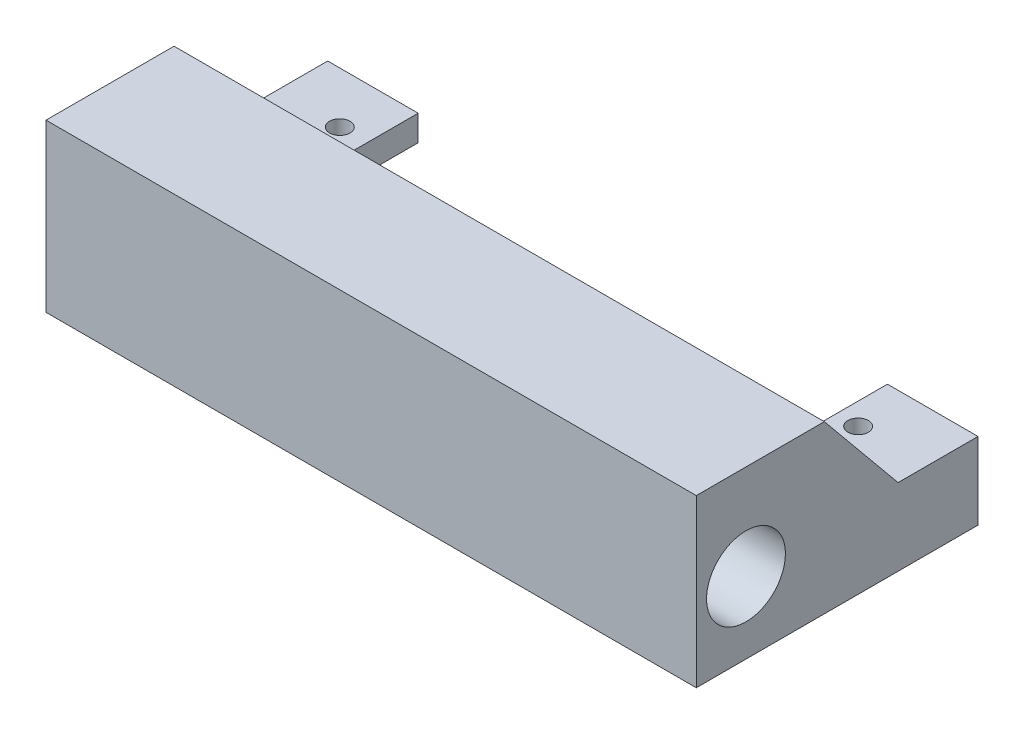
ISO-10303-21;
HEADER;
FILE_DESCRIPTION(('STEP AP214'),'2;1');
FILE_NAME('part.step','',(''),(''),'','','');
FILE_SCHEMA(('AUTOMOTIVE_DESIGN { 1 0 10303 214 1 1 1 1 }'));
ENDSEC;
DATA;
#1=APPLICATION_CONTEXT('core data for automotive mechanical design processes');
#2=APPLICATION_PROTOCOL_DEFINITION('international standard','automotive_design',2000,#1);
#3=PRODUCT_CONTEXT('',#1,'mechanical');
#4=PRODUCT('Part','Part','',(#3));
#5=PRODUCT_RELATED_PRODUCT_CATEGORY('part','',(#4));
#6=PRODUCT_DEFINITION_FORMATION('','',#4);
#7=PRODUCT_DEFINITION_CONTEXT('part definition',#1,'design');
#8=PRODUCT_DEFINITION('design','',#6,#7);
#9=PRODUCT_DEFINITION_SHAPE('','',#8);
#10=(LENGTH_UNIT() NAMED_UNIT(*) SI_UNIT(.MILLI.,.METRE.));
#11=(NAMED_UNIT(*) PLANE_ANGLE_UNIT() SI_UNIT($,.RADIAN.));
#12=(NAMED_UNIT(*) SI_UNIT($,.STERADIAN.) SOLID_ANGLE_UNIT());
#13=UNCERTAINTY_MEASURE_WITH_UNIT(LENGTH_MEASURE(1.E-05),#10,'distance_accuracy_value','');
#14=(GEOMETRIC_REPRESENTATION_CONTEXT(3) GLOBAL_UNCERTAINTY_ASSIGNED_CONTEXT((#13)) GLOBAL_UNIT_ASSIGNED_CONTEXT((#10,
#11,#12)) REPRESENTATION_CONTEXT('',''));
#15=CARTESIAN_POINT('',(0.,0.,0.));
#16=DIRECTION('',(0.,0.,1.));
#17=DIRECTION('',(1.,0.,0.));
#18=AXIS2_PLACEMENT_3D('',#15,#16,#17);
#19=CARTESIAN_POINT('',(0.,5.,0.));
#20=DIRECTION('',(0.,1.,0.));
#21=DIRECTION('',(0.,0.,1.));
#22=AXIS2_PLACEMENT_3D('',#19,#20,#21);
#23=PLANE('',#22);
#24=CARTESIAN_POINT('',(-50.22,5.,-15.2));
#25=DIRECTION('',(0.,1.,0.));
#26=DIRECTION('',(0.,0.,1.));
#27=AXIS2_PLACEMENT_3D('',#24,#25,#26);
#28=CIRCLE('',#27,2.);
#29=CARTESIAN_POINT('',(-50.22,5.,-13.2));
#30=VERTEX_POINT('',#29);
#31=EDGE_CURVE('E189',#30,#30,#28,.T.);
#32=ORIENTED_EDGE('',*,*,#31,.F.);
#33=EDGE_LOOP('',(#32));
#34=FACE_BOUND('',#33,.T.);
#35=DIRECTION('',(0.,0.,-1.));
#36=VECTOR('',#35,1.);
#37=CARTESIAN_POINT('',(-62.58,5.,0.));
#38=LINE('',#37,#36);
#39=CARTESIAN_POINT('',(-62.58,5.,-9.59999999999992));
#40=VERTEX_POINT('',#39);
#41=CARTESIAN_POINT('',(-62.58,5.,-25.2));
#42=VERTEX_POINT('',#41);
#43=EDGE_CURVE('E201',#40,#42,#38,.T.);
#44=ORIENTED_EDGE('',*,*,#43,.F.);
#45=DIRECTION('',(1.,0.,0.));
#46=VECTOR('',#45,1.);
#47=CARTESIAN_POINT('',(-156.62,4.99999999999998,-9.59999999999987));
#48=LINE('',#47,#46);
#49=CARTESIAN_POINT('',(-44.92,4.99999999999998,-9.59999999999993));
#50=VERTEX_POINT('',#49);
#51=EDGE_CURVE('E262',#40,#50,#48,.T.);
#52=ORIENTED_EDGE('',*,*,#51,.T.);
#53=DIRECTION('',(0.,0.,-1.));
#54=VECTOR('',#53,1.);
#55=CARTESIAN_POINT('',(-44.92,4.99999999999998,5.80000000000001));
#56=LINE('',#55,#54);
#57=CARTESIAN_POINT('',(-44.92,4.99999999999998,-25.2));
#58=VERTEX_POINT('',#57);
#59=EDGE_CURVE('E221',#50,#58,#56,.T.);
#60=ORIENTED_EDGE('',*,*,#59,.T.);
#61=DIRECTION('',(1.,0.,0.));
#62=VECTOR('',#61,1.);
#63=CARTESIAN_POINT('',(0.,5.,-25.2));
#64=LINE('',#63,#62);
#65=EDGE_CURVE('E309',#42,#58,#64,.T.);
#66=ORIENTED_EDGE('',*,*,#65,.F.);
#67=EDGE_LOOP('',(#44,#52,#60,#66));
#68=FACE_BOUND('',#67,.T.);
#69=ADVANCED_FACE('F48',(#34,#68),#23,.T.);
#70=CARTESIAN_POINT('',(0.,12.5,0.));
#71=DIRECTION('',(0.,1.,0.));
#72=DIRECTION('',(0.,0.,1.));
#73=AXIS2_PLACEMENT_3D('',#70,#71,#72);
#74=PLANE('',#73);
#75=DIRECTION('',(0.,0.,-1.));
#76=VECTOR('',#75,1.);
#77=CARTESIAN_POINT('',(-44.92,12.5,4.80000000000003));
#78=LINE('',#77,#76);
#79=CARTESIAN_POINT('',(-44.92,12.5,4.80000000000003));
#80=VERTEX_POINT('',#79);
#81=CARTESIAN_POINT('',(-44.92,12.5,0.));
#82=VERTEX_POINT('',#81);
#83=EDGE_CURVE('E214',#80,#82,#78,.T.);
#84=ORIENTED_EDGE('',*,*,#83,.F.);
#85=DIRECTION('',(-1.,0.,0.));
#86=VECTOR('',#85,1.);
#87=CARTESIAN_POINT('',(0.,12.5,4.80000000000001));
#88=LINE('',#87,#86);
#89=CARTESIAN_POINT('',(46.7,12.5,4.80000000000001));
#90=VERTEX_POINT('',#89);
#91=EDGE_CURVE('E303',#90,#80,#88,.T.);
#92=ORIENTED_EDGE('',*,*,#91,.F.);
#93=DIRECTION('',(0.,0.,-1.));
#94=VECTOR('',#93,1.);
#95=CARTESIAN_POINT('',(46.7,12.5,-3.42857142857141));
#96=LINE('',#95,#94);
#97=CARTESIAN_POINT('',(46.7,12.5,0.));
#98=VERTEX_POINT('',#97);
#99=EDGE_CURVE('E252',#90,#98,#96,.T.);
#100=ORIENTED_EDGE('',*,*,#99,.T.);
#101=DIRECTION('',(1.,0.,0.));
#102=VECTOR('',#101,1.);
#103=CARTESIAN_POINT('',(0.,12.5,0.));
#104=LINE('',#103,#102);
#105=EDGE_CURVE('E301',#82,#98,#104,.T.);
#106=ORIENTED_EDGE('',*,*,#105,.F.);
#107=EDGE_LOOP('',(#84,#92,#100,#106));
#108=FACE_BOUND('',#107,.T.);
#109=ADVANCED_FACE('F343',(#108),#74,.T.);
#110=CARTESIAN_POINT('',(0.,0.,4.80000000000001));
#111=DIRECTION('',(0.,0.,1.));
#112=DIRECTION('',(1.,0.,0.));
#113=AXIS2_PLACEMENT_3D('',#110,#111,#112);
#114=PLANE('',#113);
#115=ORIENTED_EDGE('',*,*,#91,.T.);
#116=DIRECTION('',(0.,-1.,0.));
#117=VECTOR('',#116,1.);
#118=CARTESIAN_POINT('',(-44.92,22.5,4.80000000000003));
#119=LINE('',#118,#117);
#120=CARTESIAN_POINT('',(-44.92,22.5,4.80000000000003));
#121=VERTEX_POINT('',#120);
#122=EDGE_CURVE('E211',#121,#80,#119,.T.);
#123=ORIENTED_EDGE('',*,*,#122,.F.);
#124=DIRECTION('',(1.,0.,0.));
#125=VECTOR('',#124,1.);
#126=CARTESIAN_POINT('',(0.,22.5,4.80000000000001));
#127=LINE('',#126,#125);
#128=CARTESIAN_POINT('',(46.7,22.5,4.80000000000003));
#129=VERTEX_POINT('',#128);
#130=EDGE_CURVE('E298',#121,#129,#127,.T.);
#131=ORIENTED_EDGE('',*,*,#130,.T.);
#132=DIRECTION('',(0.,-1.,0.));
#133=VECTOR('',#132,1.);
#134=CARTESIAN_POINT('',(46.7,12.5,4.80000000000001));
#135=LINE('',#134,#133);
#136=EDGE_CURVE('E249',#129,#90,#135,.T.);
#137=ORIENTED_EDGE('',*,*,#136,.T.);
#138=EDGE_LOOP('',(#115,#123,#131,#137));
#139=FACE_BOUND('',#138,.T.);
#140=ADVANCED_FACE('F350',(#139),#114,.F.);
#141=CARTESIAN_POINT('',(96.62,3.99999999999998,20.1000000000001));
#142=DIRECTION('',(-1.,0.,0.));
#143=DIRECTION('',(0.,0.,1.));
#144=AXIS2_PLACEMENT_3D('',#141,#142,#143);
#145=CYLINDRICAL_SURFACE('',#144,4.5);
#146=CARTESIAN_POINT('',(-38.08,3.99999999999998,20.1));
#147=DIRECTION('',(-1.,0.,0.));
#148=DIRECTION('',(0.,0.,1.));
#149=AXIS2_PLACEMENT_3D('',#146,#147,#148);
#150=CIRCLE('',#149,4.5);
#151=CARTESIAN_POINT('',(-38.08,3.99999999999998,24.6));
#152=VERTEX_POINT('',#151);
#153=EDGE_CURVE('E290',#152,#152,#150,.F.);
#154=ORIENTED_EDGE('',*,*,#153,.F.);
#155=EDGE_LOOP('',(#154));
#156=FACE_BOUND('',#155,.T.);
#157=CARTESIAN_POINT('',(39.88,3.99999999999998,20.1));
#158=DIRECTION('',(1.,0.,0.));
#159=DIRECTION('',(0.,0.,-1.));
#160=AXIS2_PLACEMENT_3D('',#157,#158,#159);
#161=CIRCLE('',#160,4.5);
#162=CARTESIAN_POINT('',(39.88,3.99999999999998,15.6));
#163=VERTEX_POINT('',#162);
#164=EDGE_CURVE('E228',#163,#163,#161,.T.);
#165=ORIENTED_EDGE('',*,*,#164,.T.);
#166=EDGE_LOOP('',(#165));
#167=FACE_BOUND('',#166,.T.);
#168=ADVANCED_FACE('F456',(#156,#167),#145,.F.);
#169=CARTESIAN_POINT('',(0.,5.,-25.2));
#170=DIRECTION('',(0.,0.,-1.));
#171=DIRECTION('',(-1.,0.,0.));
#172=AXIS2_PLACEMENT_3D('',#169,#170,#171);
#173=PLANE('',#172);
#174=DIRECTION('',(-1.,0.,0.));
#175=VECTOR('',#174,1.);
#176=CARTESIAN_POINT('',(63.38,-10.,-25.2));
#177=LINE('',#176,#175);
#178=CARTESIAN_POINT('',(64.3800000000001,-10.,-25.2));
#179=VERTEX_POINT('',#178);
#180=CARTESIAN_POINT('',(59.18,-10.,-25.2));
#181=VERTEX_POINT('',#180);
#182=EDGE_CURVE('E166',#179,#181,#177,.T.);
#183=ORIENTED_EDGE('',*,*,#182,.T.);
#184=DIRECTION('',(0.,1.,0.));
#185=VECTOR('',#184,1.);
#186=CARTESIAN_POINT('',(59.18,-10.,-25.2));
#187=LINE('',#186,#185);
#188=CARTESIAN_POINT('',(59.18,0.,-25.2));
#189=VERTEX_POINT('',#188);
#190=EDGE_CURVE('E169',#181,#189,#187,.T.);
#191=ORIENTED_EDGE('',*,*,#190,.T.);
#192=DIRECTION('',(1.,0.,0.));
#193=VECTOR('',#192,1.);
#194=CARTESIAN_POINT('',(0.,0.,-25.2));
#195=LINE('',#194,#193);
#196=CARTESIAN_POINT('',(46.7,0.,-25.2));
#197=VERTEX_POINT('',#196);
#198=EDGE_CURVE('E63',#197,#189,#195,.T.);
#199=ORIENTED_EDGE('',*,*,#198,.F.);
#200=DIRECTION('',(0.,-1.,0.));
#201=VECTOR('',#200,1.);
#202=CARTESIAN_POINT('',(46.7,0.,-25.2));
#203=LINE('',#202,#201);
#204=CARTESIAN_POINT('',(46.7,4.99999999999998,-25.2));
#205=VERTEX_POINT('',#204);
#206=EDGE_CURVE('E273',#205,#197,#203,.T.);
#207=ORIENTED_EDGE('',*,*,#206,.F.);
#208=DIRECTION('',(1.,0.,0.));
#209=VECTOR('',#208,1.);
#210=CARTESIAN_POINT('',(0.,5.,-25.2));
#211=LINE('',#210,#209);
#212=CARTESIAN_POINT('',(64.38,4.99999999999998,-25.2));
#213=VERTEX_POINT('',#212);
#214=EDGE_CURVE('E307',#205,#213,#211,.T.);
#215=ORIENTED_EDGE('',*,*,#214,.T.);
#216=DIRECTION('',(0.,1.,0.));
#217=VECTOR('',#216,1.);
#218=CARTESIAN_POINT('',(64.38,4.99999999999998,-25.2));
#219=LINE('',#218,#217);
#220=EDGE_CURVE('E171',#179,#213,#219,.T.);
#221=ORIENTED_EDGE('',*,*,#220,.F.);
#222=EDGE_LOOP('',(#183,#191,#199,#207,#215,#221));
#223=FACE_BOUND('',#222,.T.);
#224=ADVANCED_FACE('F50',(#223),#173,.T.);
#225=CARTESIAN_POINT('',(0.,5.,0.));
#226=DIRECTION('',(0.,0.,-1.));
#227=DIRECTION('',(-1.,0.,0.));
#228=AXIS2_PLACEMENT_3D('',#225,#226,#227);
#229=PLANE('',#228);
#230=DIRECTION('',(0.,-1.,0.));
#231=VECTOR('',#230,1.);
#232=CARTESIAN_POINT('',(-44.92,4.99999999999998,0.));
#233=LINE('',#232,#231);
#234=CARTESIAN_POINT('',(-44.92,0.,0.));
#235=VERTEX_POINT('',#234);
#236=EDGE_CURVE('E224',#82,#235,#233,.T.);
#237=ORIENTED_EDGE('',*,*,#236,.F.);
#238=ORIENTED_EDGE('',*,*,#105,.T.);
#239=DIRECTION('',(0.,-1.,0.));
#240=VECTOR('',#239,1.);
#241=CARTESIAN_POINT('',(46.7,4.99999999999998,0.));
#242=LINE('',#241,#240);
#243=CARTESIAN_POINT('',(46.7,0.,0.));
#244=VERTEX_POINT('',#243);
#245=EDGE_CURVE('E274',#98,#244,#242,.T.);
#246=ORIENTED_EDGE('',*,*,#245,.T.);
#247=DIRECTION('',(-1.,0.,0.));
#248=VECTOR('',#247,1.);
#249=CARTESIAN_POINT('',(196.62,0.,0.));
#250=LINE('',#249,#248);
#251=EDGE_CURVE('E296',#244,#235,#250,.T.);
#252=ORIENTED_EDGE('',*,*,#251,.T.);
#253=EDGE_LOOP('',(#237,#238,#246,#252));
#254=FACE_BOUND('',#253,.T.);
#255=ADVANCED_FACE('F363',(#254),#229,.T.);
#256=CARTESIAN_POINT('',(0.,5.,-25.2));
#257=DIRECTION('',(0.,0.,-1.));
#258=DIRECTION('',(-1.,0.,0.));
#259=AXIS2_PLACEMENT_3D('',#256,#257,#258);
#260=PLANE('',#259);
#261=DIRECTION('',(0.,-1.,0.));
#262=VECTOR('',#261,1.);
#263=CARTESIAN_POINT('',(-62.58,-10.,-25.2));
#264=LINE('',#263,#262);
#265=CARTESIAN_POINT('',(-62.58,-10.,-25.2));
#266=VERTEX_POINT('',#265);
#267=EDGE_CURVE('E194',#42,#266,#264,.T.);
#268=ORIENTED_EDGE('',*,*,#267,.F.);
#269=ORIENTED_EDGE('',*,*,#65,.T.);
#270=DIRECTION('',(0.,-1.,0.));
#271=VECTOR('',#270,1.);
#272=CARTESIAN_POINT('',(-44.92,0.,-25.2));
#273=LINE('',#272,#271);
#274=CARTESIAN_POINT('',(-44.92,0.,-25.2));
#275=VERTEX_POINT('',#274);
#276=EDGE_CURVE('E217',#58,#275,#273,.T.);
#277=ORIENTED_EDGE('',*,*,#276,.T.);
#278=DIRECTION('',(1.,0.,0.));
#279=VECTOR('',#278,1.);
#280=CARTESIAN_POINT('',(0.,0.,-25.2));
#281=LINE('',#280,#279);
#282=CARTESIAN_POINT('',(-58.38,0.,-25.2));
#283=VERTEX_POINT('',#282);
#284=EDGE_CURVE('E310',#283,#275,#281,.T.);
#285=ORIENTED_EDGE('',*,*,#284,.F.);
#286=DIRECTION('',(0.,-1.,0.));
#287=VECTOR('',#286,1.);
#288=CARTESIAN_POINT('',(-58.38,5.,-25.2));
#289=LINE('',#288,#287);
#290=CARTESIAN_POINT('',(-58.38,-10.,-25.2));
#291=VERTEX_POINT('',#290);
#292=EDGE_CURVE('E175',#283,#291,#289,.T.);
#293=ORIENTED_EDGE('',*,*,#292,.T.);
#294=DIRECTION('',(1.,0.,0.));
#295=VECTOR('',#294,1.);
#296=CARTESIAN_POINT('',(-63.38,-10.,-25.2));
#297=LINE('',#296,#295);
#298=EDGE_CURVE('E285',#266,#291,#297,.T.);
#299=ORIENTED_EDGE('',*,*,#298,.F.);
#300=EDGE_LOOP('',(#268,#269,#277,#285,#293,#299));
#301=FACE_BOUND('',#300,.T.);
#302=ADVANCED_FACE('F357',(#301),#260,.T.);
#303=CARTESIAN_POINT('',(50.9800000000001,4.99999999999998,-15.2));
#304=DIRECTION('',(0.,1.,0.));
#305=DIRECTION('',(0.,0.,1.));
#306=AXIS2_PLACEMENT_3D('',#303,#304,#305);
#307=CIRCLE('',#306,2.);
#308=CARTESIAN_POINT('',(50.9800000000001,4.99999999999998,-13.2));
#309=VERTEX_POINT('',#308);
#310=EDGE_CURVE('E263',#309,#309,#307,.T.);
#311=ORIENTED_EDGE('',*,*,#310,.F.);
#312=EDGE_LOOP('',(#311));
#313=FACE_BOUND('',#312,.T.);
#314=DIRECTION('',(0.,0.,-1.));
#315=VECTOR('',#314,1.);
#316=CARTESIAN_POINT('',(46.7,4.99999999999998,0.));
#317=LINE('',#316,#315);
#318=CARTESIAN_POINT('',(46.7,4.99999999999998,-9.59999999999999));
#319=VERTEX_POINT('',#318);
#320=EDGE_CURVE('E176',#319,#205,#317,.T.);
#321=ORIENTED_EDGE('',*,*,#320,.F.);
#322=CARTESIAN_POINT('',(64.3800000000001,4.99999999999998,-9.59999999999999));
#323=VERTEX_POINT('',#322);
#324=EDGE_CURVE('E260',#319,#323,#48,.T.);
#325=ORIENTED_EDGE('',*,*,#324,.T.);
#326=DIRECTION('',(0.,0.,1.));
#327=VECTOR('',#326,1.);
#328=CARTESIAN_POINT('',(64.3800000000001,4.99999999999998,-9.59999999999999));
#329=LINE('',#328,#327);
#330=EDGE_CURVE('E240',#213,#323,#329,.T.);
#331=ORIENTED_EDGE('',*,*,#330,.F.);
#332=ORIENTED_EDGE('',*,*,#214,.F.);
#333=EDGE_LOOP('',(#321,#325,#331,#332));
#334=FACE_BOUND('',#333,.T.);
#335=ADVANCED_FACE('F346',(#313,#334),#23,.T.);
#336=CARTESIAN_POINT('',(0.,0.,0.));
#337=DIRECTION('',(0.,1.,0.));
#338=DIRECTION('',(0.,0.,1.));
#339=AXIS2_PLACEMENT_3D('',#336,#337,#338);
#340=PLANE('',#339);
#341=CARTESIAN_POINT('',(-50.22,0.,-15.2));
#342=DIRECTION('',(0.,1.,0.));
#343=DIRECTION('',(0.,0.,1.));
#344=AXIS2_PLACEMENT_3D('',#341,#342,#343);
#345=CIRCLE('',#344,2.);
#346=CARTESIAN_POINT('',(-50.22,0.,-13.2));
#347=VERTEX_POINT('',#346);
#348=EDGE_CURVE('E193',#347,#347,#345,.T.);
#349=ORIENTED_EDGE('',*,*,#348,.T.);
#350=EDGE_LOOP('',(#349));
#351=FACE_BOUND('',#350,.T.);
#352=CARTESIAN_POINT('',(50.98,0.,-15.2));
#353=DIRECTION('',(0.,1.,0.));
#354=DIRECTION('',(0.,0.,1.));
#355=AXIS2_PLACEMENT_3D('',#352,#353,#354);
#356=CIRCLE('',#355,2.);
#357=CARTESIAN_POINT('',(50.98,0.,-13.2));
#358=VERTEX_POINT('',#357);
#359=EDGE_CURVE('E266',#358,#358,#356,.T.);
#360=ORIENTED_EDGE('',*,*,#359,.T.);
#361=EDGE_LOOP('',(#360));
#362=FACE_BOUND('',#361,.T.);
#363=ORIENTED_EDGE('',*,*,#198,.T.);
#364=DIRECTION('',(0.,0.,-1.));
#365=VECTOR('',#364,1.);
#366=CARTESIAN_POINT('',(59.18,0.,5.58));
#367=LINE('',#366,#365);
#368=CARTESIAN_POINT('',(59.18,0.,5.20000000000001));
#369=VERTEX_POINT('',#368);
#370=EDGE_CURVE('E67',#369,#189,#367,.T.);
#371=ORIENTED_EDGE('',*,*,#370,.F.);
#372=DIRECTION('',(-1.,0.,0.));
#373=VECTOR('',#372,1.);
#374=CARTESIAN_POINT('',(59.38,0.,5.20000000000001));
#375=LINE('',#374,#373);
#376=CARTESIAN_POINT('',(-58.38,0.,5.19999999999998));
#377=VERTEX_POINT('',#376);
#378=EDGE_CURVE('E267',#369,#377,#375,.T.);
#379=ORIENTED_EDGE('',*,*,#378,.T.);
#380=DIRECTION('',(0.,0.,-1.));
#381=VECTOR('',#380,1.);
#382=CARTESIAN_POINT('',(-58.38,0.,0.));
#383=LINE('',#382,#381);
#384=EDGE_CURVE('E306',#377,#283,#383,.T.);
#385=ORIENTED_EDGE('',*,*,#384,.T.);
#386=ORIENTED_EDGE('',*,*,#284,.T.);
#387=DIRECTION('',(0.,0.,-1.));
#388=VECTOR('',#387,1.);
#389=CARTESIAN_POINT('',(-44.92,0.,5.80000000000003));
#390=LINE('',#389,#388);
#391=EDGE_CURVE('E220',#235,#275,#390,.T.);
#392=ORIENTED_EDGE('',*,*,#391,.F.);
#393=ORIENTED_EDGE('',*,*,#251,.F.);
#394=DIRECTION('',(0.,0.,-1.));
#395=VECTOR('',#394,1.);
#396=CARTESIAN_POINT('',(46.7,0.,0.));
#397=LINE('',#396,#395);
#398=EDGE_CURVE('E277',#244,#197,#397,.T.);
#399=ORIENTED_EDGE('',*,*,#398,.T.);
#400=EDGE_LOOP('',(#363,#371,#379,#385,#386,#392,#393,#399));
#401=FACE_BOUND('',#400,.T.);
#402=ADVANCED_FACE('F326',(#351,#362,#401),#340,.F.);
#403=CARTESIAN_POINT('',(0.,-10.,29.8));
#404=DIRECTION('',(0.,1.,0.));
#405=DIRECTION('',(0.,0.,1.));
#406=AXIS2_PLACEMENT_3D('',#403,#404,#405);
#407=PLANE('',#406);
#408=DIRECTION('',(-1.,0.,0.));
#409=VECTOR('',#408,1.);
#410=CARTESIAN_POINT('',(59.38,-10.,5.20000000000001));
#411=LINE('',#410,#409);
#412=CARTESIAN_POINT('',(59.18,-10.,5.2));
#413=VERTEX_POINT('',#412);
#414=CARTESIAN_POINT('',(-58.38,-10.,5.19999999999998));
#415=VERTEX_POINT('',#414);
#416=EDGE_CURVE('E182',#413,#415,#411,.T.);
#417=ORIENTED_EDGE('',*,*,#416,.F.);
#418=DIRECTION('',(0.,0.,-1.));
#419=VECTOR('',#418,1.);
#420=CARTESIAN_POINT('',(59.18,-10.,5.58000000000002));
#421=LINE('',#420,#419);
#422=EDGE_CURVE('E179',#413,#181,#421,.T.);
#423=ORIENTED_EDGE('',*,*,#422,.T.);
#424=ORIENTED_EDGE('',*,*,#182,.F.);
#425=DIRECTION('',(0.,0.,-1.));
#426=VECTOR('',#425,1.);
#427=CARTESIAN_POINT('',(64.3800000000001,-10.,-25.2));
#428=LINE('',#427,#426);
#429=CARTESIAN_POINT('',(64.3800000000001,-10.,29.8));
#430=VERTEX_POINT('',#429);
#431=EDGE_CURVE('E237',#430,#179,#428,.T.);
#432=ORIENTED_EDGE('',*,*,#431,.F.);
#433=DIRECTION('',(1.,0.,0.));
#434=VECTOR('',#433,1.);
#435=CARTESIAN_POINT('',(0.,-10.,29.8));
#436=LINE('',#435,#434);
#437=CARTESIAN_POINT('',(-62.58,-10.,29.8));
#438=VERTEX_POINT('',#437);
#439=EDGE_CURVE('E291',#438,#430,#436,.T.);
#440=ORIENTED_EDGE('',*,*,#439,.F.);
#441=DIRECTION('',(0.,0.,-1.));
#442=VECTOR('',#441,1.);
#443=CARTESIAN_POINT('',(-62.58,-10.,195.58));
#444=LINE('',#443,#442);
#445=EDGE_CURVE('E196',#438,#266,#444,.T.);
#446=ORIENTED_EDGE('',*,*,#445,.T.);
#447=ORIENTED_EDGE('',*,*,#298,.T.);
#448=DIRECTION('',(0.,0.,1.));
#449=VECTOR('',#448,1.);
#450=CARTESIAN_POINT('',(-58.38,-10.,-25.2));
#451=LINE('',#450,#449);
#452=EDGE_CURVE('E283',#291,#415,#451,.T.);
#453=ORIENTED_EDGE('',*,*,#452,.T.);
#454=EDGE_LOOP('',(#417,#423,#424,#432,#440,#446,#447,#453));
#455=FACE_BOUND('',#454,.T.);
#456=ADVANCED_FACE('F180',(#455),#407,.F.);
#457=CARTESIAN_POINT('',(0.,22.5,29.8));
#458=DIRECTION('',(0.,1.,0.));
#459=DIRECTION('',(0.,0.,1.));
#460=AXIS2_PLACEMENT_3D('',#457,#458,#459);
#461=PLANE('',#460);
#462=DIRECTION('',(0.,0.,-1.));
#463=VECTOR('',#462,1.);
#464=CARTESIAN_POINT('',(-62.58,22.5,29.8));
#465=LINE('',#464,#463);
#466=CARTESIAN_POINT('',(-62.58,22.5,29.8));
#467=VERTEX_POINT('',#466);
#468=CARTESIAN_POINT('',(-62.58,22.5,4.80000000000001));
#469=VERTEX_POINT('',#468);
#470=EDGE_CURVE('E199',#467,#469,#465,.T.);
#471=ORIENTED_EDGE('',*,*,#470,.F.);
#472=DIRECTION('',(1.,0.,0.));
#473=VECTOR('',#472,1.);
#474=CARTESIAN_POINT('',(0.,22.5,29.8));
#475=LINE('',#474,#473);
#476=CARTESIAN_POINT('',(64.3800000000001,22.5,29.8));
#477=VERTEX_POINT('',#476);
#478=EDGE_CURVE('E293',#467,#477,#475,.T.);
#479=ORIENTED_EDGE('',*,*,#478,.T.);
#480=DIRECTION('',(0.,0.,1.));
#481=VECTOR('',#480,1.);
#482=CARTESIAN_POINT('',(64.3800000000001,22.5,29.8));
#483=LINE('',#482,#481);
#484=CARTESIAN_POINT('',(64.3800000000001,22.5,4.8));
#485=VERTEX_POINT('',#484);
#486=EDGE_CURVE('E246',#485,#477,#483,.T.);
#487=ORIENTED_EDGE('',*,*,#486,.F.);
#488=DIRECTION('',(1.,0.,0.));
#489=VECTOR('',#488,1.);
#490=CARTESIAN_POINT('',(46.7,22.5,4.80000000000003));
#491=LINE('',#490,#489);
#492=EDGE_CURVE('E255',#129,#485,#491,.T.);
#493=ORIENTED_EDGE('',*,*,#492,.F.);
#494=ORIENTED_EDGE('',*,*,#130,.F.);
#495=EDGE_CURVE('E294',#469,#121,#127,.T.);
#496=ORIENTED_EDGE('',*,*,#495,.F.);
#497=EDGE_LOOP('',(#471,#479,#487,#493,#494,#496));
#498=FACE_BOUND('',#497,.T.);
#499=ADVANCED_FACE('F393',(#498),#461,.T.);
#500=CARTESIAN_POINT('',(0.,0.,29.8));
#501=DIRECTION('',(0.,0.,1.));
#502=DIRECTION('',(1.,0.,0.));
#503=AXIS2_PLACEMENT_3D('',#500,#501,#502);
#504=PLANE('',#503);
#505=DIRECTION('',(0.,1.,0.));
#506=VECTOR('',#505,1.);
#507=CARTESIAN_POINT('',(-62.58,0.,29.8));
#508=LINE('',#507,#506);
#509=EDGE_CURVE('E203',#438,#467,#508,.T.);
#510=ORIENTED_EDGE('',*,*,#509,.F.);
#511=ORIENTED_EDGE('',*,*,#439,.T.);
#512=DIRECTION('',(0.,-1.,0.));
#513=VECTOR('',#512,1.);
#514=CARTESIAN_POINT('',(64.3800000000001,-10.,29.8));
#515=LINE('',#514,#513);
#516=EDGE_CURVE('E234',#477,#430,#515,.T.);
#517=ORIENTED_EDGE('',*,*,#516,.F.);
#518=ORIENTED_EDGE('',*,*,#478,.F.);
#519=EDGE_LOOP('',(#510,#511,#517,#518));
#520=FACE_BOUND('',#519,.T.);
#521=ADVANCED_FACE('F387',(#520),#504,.T.);
#522=CARTESIAN_POINT('',(-38.08,3.99999999999998,20.1));
#523=DIRECTION('',(-1.,0.,0.));
#524=DIRECTION('',(0.,0.,1.));
#525=AXIS2_PLACEMENT_3D('',#522,#523,#524);
#526=PLANE('',#525);
#527=CARTESIAN_POINT('',(-38.08,3.99999999999998,20.1));
#528=DIRECTION('',(-1.,0.,0.));
#529=DIRECTION('',(0.,0.,1.));
#530=AXIS2_PLACEMENT_3D('',#527,#528,#529);
#531=CIRCLE('',#530,7.7);
#532=CARTESIAN_POINT('',(-38.08,3.99999999999998,27.8));
#533=VERTEX_POINT('',#532);
#534=EDGE_CURVE('E287',#533,#533,#531,.T.);
#535=ORIENTED_EDGE('',*,*,#534,.T.);
#536=EDGE_LOOP('',(#535));
#537=FACE_BOUND('',#536,.T.);
#538=ORIENTED_EDGE('',*,*,#153,.T.);
#539=EDGE_LOOP('',(#538));
#540=FACE_BOUND('',#539,.T.);
#541=ADVANCED_FACE('F449',(#537,#540),#526,.T.);
#542=CARTESIAN_POINT('',(-38.08,3.99999999999998,20.1));
#543=DIRECTION('',(-1.,0.,0.));
#544=DIRECTION('',(0.,0.,1.));
#545=AXIS2_PLACEMENT_3D('',#542,#543,#544);
#546=CYLINDRICAL_SURFACE('',#545,7.7);
#547=CARTESIAN_POINT('',(-62.58,4.,20.1));
#548=DIRECTION('',(1.,0.,0.));
#549=DIRECTION('',(0.,0.,-1.));
#550=AXIS2_PLACEMENT_3D('',#547,#548,#549);
#551=CIRCLE('',#550,7.7);
#552=CARTESIAN_POINT('',(-62.58,4.,12.4));
#553=VERTEX_POINT('',#552);
#554=EDGE_CURVE('E205',#553,#553,#551,.F.);
#555=ORIENTED_EDGE('',*,*,#554,.T.);
#556=EDGE_LOOP('',(#555));
#557=FACE_BOUND('',#556,.T.);
#558=ORIENTED_EDGE('',*,*,#534,.F.);
#559=EDGE_LOOP('',(#558));
#560=FACE_BOUND('',#559,.T.);
#561=ADVANCED_FACE('F447',(#557,#560),#546,.F.);
#562=CARTESIAN_POINT('',(38.08,3.99999999999998,20.1));
#563=DIRECTION('',(1.,0.,0.));
#564=DIRECTION('',(0.,0.,-1.));
#565=AXIS2_PLACEMENT_3D('',#562,#563,#564);
#566=CYLINDRICAL_SURFACE('',#565,7.7);
#567=CARTESIAN_POINT('',(39.88,3.99999999999998,20.1));
#568=DIRECTION('',(1.,0.,0.));
#569=DIRECTION('',(0.,0.,-1.));
#570=AXIS2_PLACEMENT_3D('',#567,#568,#569);
#571=CIRCLE('',#570,7.7);
#572=CARTESIAN_POINT('',(39.88,3.99999999999998,12.4));
#573=VERTEX_POINT('',#572);
#574=EDGE_CURVE('E312',#573,#573,#571,.T.);
#575=ORIENTED_EDGE('',*,*,#574,.F.);
#576=EDGE_LOOP('',(#575));
#577=FACE_BOUND('',#576,.T.);
#578=CARTESIAN_POINT('',(64.3800000000001,3.99999999999998,20.1));
#579=DIRECTION('',(1.,0.,0.));
#580=DIRECTION('',(0.,0.,-1.));
#581=AXIS2_PLACEMENT_3D('',#578,#579,#580);
#582=CIRCLE('',#581,7.69999999999999);
#583=CARTESIAN_POINT('',(64.3800000000001,3.99999999999998,12.4));
#584=VERTEX_POINT('',#583);
#585=EDGE_CURVE('E231',#584,#584,#582,.T.);
#586=ORIENTED_EDGE('',*,*,#585,.T.);
#587=EDGE_LOOP('',(#586));
#588=FACE_BOUND('',#587,.T.);
#589=ADVANCED_FACE('F444',(#577,#588),#566,.F.);
#590=CARTESIAN_POINT('',(-58.38,0.,0.));
#591=DIRECTION('',(-1.,0.,0.));
#592=DIRECTION('',(0.,0.,1.));
#593=AXIS2_PLACEMENT_3D('',#590,#591,#592);
#594=PLANE('',#593);
#595=ORIENTED_EDGE('',*,*,#384,.F.);
#596=DIRECTION('',(0.,-1.,0.));
#597=VECTOR('',#596,1.);
#598=CARTESIAN_POINT('',(-58.38,0.,5.19999999999998));
#599=LINE('',#598,#597);
#600=EDGE_CURVE('E269',#377,#415,#599,.T.);
#601=ORIENTED_EDGE('',*,*,#600,.T.);
#602=ORIENTED_EDGE('',*,*,#452,.F.);
#603=ORIENTED_EDGE('',*,*,#292,.F.);
#604=EDGE_LOOP('',(#595,#601,#602,#603));
#605=FACE_BOUND('',#604,.T.);
#606=ADVANCED_FACE('F416',(#605),#594,.F.);
#607=CARTESIAN_POINT('',(46.7,0.,0.));
#608=DIRECTION('',(1.,0.,0.));
#609=DIRECTION('',(0.,0.,-1.));
#610=AXIS2_PLACEMENT_3D('',#607,#608,#609);
#611=PLANE('',#610);
#612=ORIENTED_EDGE('',*,*,#245,.F.);
#613=ORIENTED_EDGE('',*,*,#99,.F.);
#614=ORIENTED_EDGE('',*,*,#136,.F.);
#615=DIRECTION('',(0.,-0.772184915054997,-0.63539787295954));
#616=VECTOR('',#615,1.);
#617=CARTESIAN_POINT('',(46.7,6.72884094935844,-8.17741087595646));
#618=LINE('',#617,#616);
#619=EDGE_CURVE('E257',#129,#319,#618,.T.);
#620=ORIENTED_EDGE('',*,*,#619,.T.);
#621=ORIENTED_EDGE('',*,*,#320,.T.);
#622=ORIENTED_EDGE('',*,*,#206,.T.);
#623=ORIENTED_EDGE('',*,*,#398,.F.);
#624=EDGE_LOOP('',(#612,#613,#614,#620,#621,#622,#623));
#625=FACE_BOUND('',#624,.T.);
#626=ADVANCED_FACE('F374',(#625),#611,.F.);
#627=CARTESIAN_POINT('',(59.38,0.,5.20000000000001));
#628=DIRECTION('',(0.,0.,1.));
#629=DIRECTION('',(1.,0.,0.));
#630=AXIS2_PLACEMENT_3D('',#627,#628,#629);
#631=PLANE('',#630);
#632=ORIENTED_EDGE('',*,*,#378,.F.);
#633=DIRECTION('',(0.,-1.,0.));
#634=VECTOR('',#633,1.);
#635=CARTESIAN_POINT('',(59.18,0.,5.20000000000001));
#636=LINE('',#635,#634);
#637=EDGE_CURVE('E13',#369,#413,#636,.T.);
#638=ORIENTED_EDGE('',*,*,#637,.T.);
#639=ORIENTED_EDGE('',*,*,#416,.T.);
#640=ORIENTED_EDGE('',*,*,#600,.F.);
#641=EDGE_LOOP('',(#632,#638,#639,#640));
#642=FACE_BOUND('',#641,.T.);
#643=ADVANCED_FACE('F418',(#642),#631,.F.);
#644=CARTESIAN_POINT('',(50.98,-5.00000000000003,-15.2));
#645=DIRECTION('',(0.,1.,0.));
#646=DIRECTION('',(0.,0.,1.));
#647=AXIS2_PLACEMENT_3D('',#644,#645,#646);
#648=CYLINDRICAL_SURFACE('',#647,2.);
#649=ORIENTED_EDGE('',*,*,#310,.T.);
#650=EDGE_LOOP('',(#649));
#651=FACE_BOUND('',#650,.T.);
#652=ORIENTED_EDGE('',*,*,#359,.F.);
#653=EDGE_LOOP('',(#652));
#654=FACE_BOUND('',#653,.T.);
#655=ADVANCED_FACE('F432',(#651,#654),#648,.F.);
#656=CARTESIAN_POINT('',(-156.62,22.5,4.80000000000014));
#657=DIRECTION('',(0.,-0.63539787295954,0.772184915054997));
#658=DIRECTION('',(0.,-0.772184915054997,-0.63539787295954));
#659=AXIS2_PLACEMENT_3D('',#656,#657,#658);
#660=PLANE('',#659);
#661=ORIENTED_EDGE('',*,*,#51,.F.);
#662=DIRECTION('',(0.,0.772184915054997,0.63539787295954));
#663=VECTOR('',#662,1.);
#664=CARTESIAN_POINT('',(-62.58,22.5,4.8000000000001));
#665=LINE('',#664,#663);
#666=EDGE_CURVE('E56',#40,#469,#665,.T.);
#667=ORIENTED_EDGE('',*,*,#666,.T.);
#668=ORIENTED_EDGE('',*,*,#495,.T.);
#669=DIRECTION('',(0.,0.772184915054998,0.635397872959539));
#670=VECTOR('',#669,1.);
#671=CARTESIAN_POINT('',(-44.92,4.99999999999998,-9.59999999999993));
#672=LINE('',#671,#670);
#673=EDGE_CURVE('E208',#50,#121,#672,.T.);
#674=ORIENTED_EDGE('',*,*,#673,.F.);
#675=EDGE_LOOP('',(#661,#667,#668,#674));
#676=FACE_BOUND('',#675,.T.);
#677=ADVANCED_FACE('F401',(#676),#660,.F.);
#678=ORIENTED_EDGE('',*,*,#619,.F.);
#679=ORIENTED_EDGE('',*,*,#492,.T.);
#680=DIRECTION('',(0.,0.772184915054997,0.63539787295954));
#681=VECTOR('',#680,1.);
#682=CARTESIAN_POINT('',(64.3800000000001,22.5,4.8));
#683=LINE('',#682,#681);
#684=EDGE_CURVE('E243',#323,#485,#683,.T.);
#685=ORIENTED_EDGE('',*,*,#684,.F.);
#686=ORIENTED_EDGE('',*,*,#324,.F.);
#687=EDGE_LOOP('',(#678,#679,#685,#686));
#688=FACE_BOUND('',#687,.T.);
#689=ADVANCED_FACE('F423',(#688),#660,.F.);
#690=CARTESIAN_POINT('',(64.3800000000001,0.,0.));
#691=DIRECTION('',(-1.,0.,0.));
#692=DIRECTION('',(0.,0.,1.));
#693=AXIS2_PLACEMENT_3D('',#690,#691,#692);
#694=PLANE('',#693);
#695=ORIENTED_EDGE('',*,*,#516,.T.);
#696=ORIENTED_EDGE('',*,*,#431,.T.);
#697=ORIENTED_EDGE('',*,*,#220,.T.);
#698=ORIENTED_EDGE('',*,*,#330,.T.);
#699=ORIENTED_EDGE('',*,*,#684,.T.);
#700=ORIENTED_EDGE('',*,*,#486,.T.);
#701=EDGE_LOOP('',(#695,#696,#697,#698,#699,#700));
#702=FACE_BOUND('',#701,.T.);
#703=ORIENTED_EDGE('',*,*,#585,.F.);
#704=EDGE_LOOP('',(#703));
#705=FACE_BOUND('',#704,.T.);
#706=ADVANCED_FACE('F379',(#702,#705),#694,.F.);
#707=CARTESIAN_POINT('',(39.88,3.99999999999998,20.1));
#708=DIRECTION('',(1.,0.,0.));
#709=DIRECTION('',(0.,0.,-1.));
#710=AXIS2_PLACEMENT_3D('',#707,#708,#709);
#711=PLANE('',#710);
#712=ORIENTED_EDGE('',*,*,#574,.T.);
#713=EDGE_LOOP('',(#712));
#714=FACE_BOUND('',#713,.T.);
#715=ORIENTED_EDGE('',*,*,#164,.F.);
#716=EDGE_LOOP('',(#715));
#717=FACE_BOUND('',#716,.T.);
#718=ADVANCED_FACE('F430',(#714,#717),#711,.T.);
#719=CARTESIAN_POINT('',(-44.92,0.,5.80000000000003));
#720=DIRECTION('',(1.,0.,0.));
#721=DIRECTION('',(0.,0.,-1.));
#722=AXIS2_PLACEMENT_3D('',#719,#720,#721);
#723=PLANE('',#722);
#724=ORIENTED_EDGE('',*,*,#59,.F.);
#725=ORIENTED_EDGE('',*,*,#673,.T.);
#726=ORIENTED_EDGE('',*,*,#122,.T.);
#727=ORIENTED_EDGE('',*,*,#83,.T.);
#728=ORIENTED_EDGE('',*,*,#236,.T.);
#729=ORIENTED_EDGE('',*,*,#391,.T.);
#730=ORIENTED_EDGE('',*,*,#276,.F.);
#731=EDGE_LOOP('',(#724,#725,#726,#727,#728,#729,#730));
#732=FACE_BOUND('',#731,.T.);
#733=ADVANCED_FACE('F339',(#732),#723,.T.);
#734=CARTESIAN_POINT('',(-62.58,-10.,195.58));
#735=DIRECTION('',(1.,0.,0.));
#736=DIRECTION('',(0.,0.,-1.));
#737=AXIS2_PLACEMENT_3D('',#734,#735,#736);
#738=PLANE('',#737);
#739=ORIENTED_EDGE('',*,*,#509,.T.);
#740=ORIENTED_EDGE('',*,*,#470,.T.);
#741=ORIENTED_EDGE('',*,*,#666,.F.);
#742=ORIENTED_EDGE('',*,*,#43,.T.);
#743=ORIENTED_EDGE('',*,*,#267,.T.);
#744=ORIENTED_EDGE('',*,*,#445,.F.);
#745=EDGE_LOOP('',(#739,#740,#741,#742,#743,#744));
#746=FACE_BOUND('',#745,.T.);
#747=ORIENTED_EDGE('',*,*,#554,.F.);
#748=EDGE_LOOP('',(#747));
#749=FACE_BOUND('',#748,.T.);
#750=ADVANCED_FACE('F331',(#746,#749),#738,.F.);
#751=CARTESIAN_POINT('',(-50.22,-215.78,-15.2));
#752=DIRECTION('',(0.,1.,0.));
#753=DIRECTION('',(0.,0.,1.));
#754=AXIS2_PLACEMENT_3D('',#751,#752,#753);
#755=CYLINDRICAL_SURFACE('',#754,2.);
#756=ORIENTED_EDGE('',*,*,#31,.T.);
#757=EDGE_LOOP('',(#756));
#758=FACE_BOUND('',#757,.T.);
#759=ORIENTED_EDGE('',*,*,#348,.F.);
#760=EDGE_LOOP('',(#759));
#761=FACE_BOUND('',#760,.T.);
#762=ADVANCED_FACE('F329',(#758,#761),#755,.F.);
#763=CARTESIAN_POINT('',(59.18,-10.,5.58000000000002));
#764=DIRECTION('',(-1.,0.,0.));
#765=DIRECTION('',(0.,0.,1.));
#766=AXIS2_PLACEMENT_3D('',#763,#764,#765);
#767=PLANE('',#766);
#768=ORIENTED_EDGE('',*,*,#637,.F.);
#769=ORIENTED_EDGE('',*,*,#370,.T.);
#770=ORIENTED_EDGE('',*,*,#190,.F.);
#771=ORIENTED_EDGE('',*,*,#422,.F.);
#772=EDGE_LOOP('',(#768,#769,#770,#771));
#773=FACE_BOUND('',#772,.T.);
#774=ADVANCED_FACE('F186',(#773),#767,.T.);
#775=CLOSED_SHELL('',(#69,#109,#140,#168,#224,#255,#302,#335,#402,#456,#499,#521,#541,#561,#589,
#606,#626,#643,#655,#677,#689,#706,#718,#733,#750,#762,#774));
#776=MANIFOLD_SOLID_BREP('B2',#775);
#777=ADVANCED_BREP_SHAPE_REPRESENTATION('',(#18,#776),#14);
#778=SHAPE_DEFINITION_REPRESENTATION(#9,#777);
ENDSEC;
END-ISO-10303-21;
